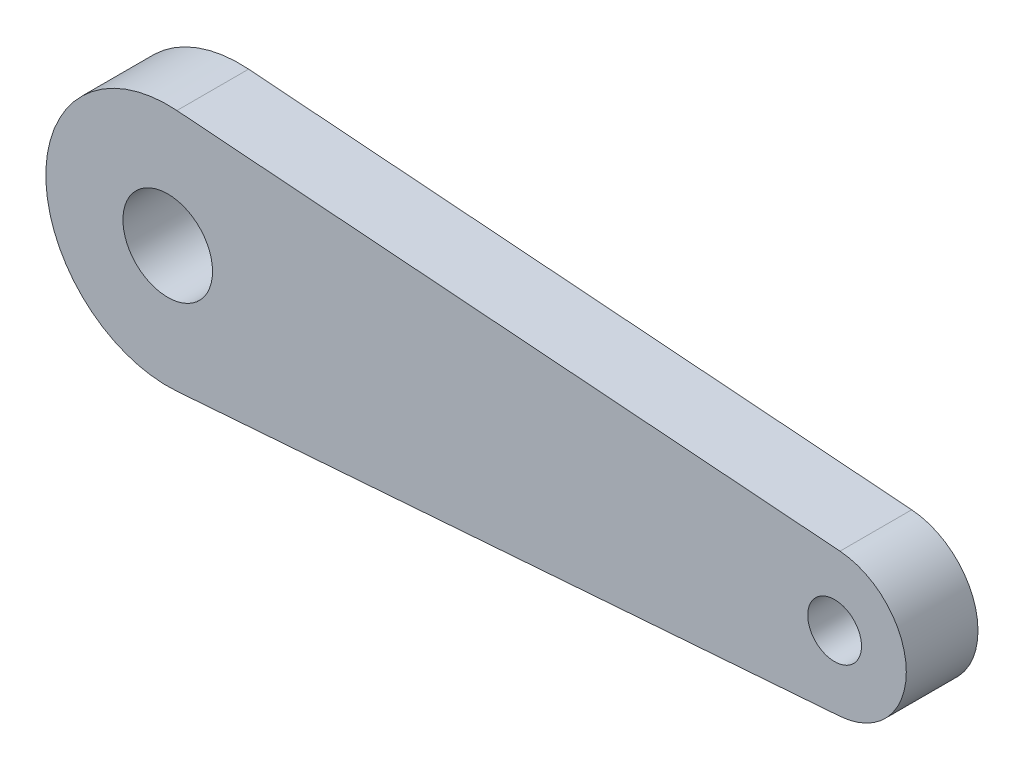
ISO-10303-21;
HEADER;
FILE_DESCRIPTION(('STEP AP214'),'2;1');
FILE_NAME('part.step','',(''),(''),'','','');
FILE_SCHEMA(('AUTOMOTIVE_DESIGN { 1 0 10303 214 1 1 1 1 }'));
ENDSEC;
DATA;
#1=APPLICATION_CONTEXT('core data for automotive mechanical design processes');
#2=APPLICATION_PROTOCOL_DEFINITION('international standard','automotive_design',2000,#1);
#3=PRODUCT_CONTEXT('',#1,'mechanical');
#4=PRODUCT('Part','Part','',(#3));
#5=PRODUCT_RELATED_PRODUCT_CATEGORY('part','',(#4));
#6=PRODUCT_DEFINITION_FORMATION('','',#4);
#7=PRODUCT_DEFINITION_CONTEXT('part definition',#1,'design');
#8=PRODUCT_DEFINITION('design','',#6,#7);
#9=PRODUCT_DEFINITION_SHAPE('','',#8);
#10=(LENGTH_UNIT() NAMED_UNIT(*) SI_UNIT(.MILLI.,.METRE.));
#11=(NAMED_UNIT(*) PLANE_ANGLE_UNIT() SI_UNIT($,.RADIAN.));
#12=(NAMED_UNIT(*) SI_UNIT($,.STERADIAN.) SOLID_ANGLE_UNIT());
#13=UNCERTAINTY_MEASURE_WITH_UNIT(LENGTH_MEASURE(1.E-05),#10,'distance_accuracy_value','');
#14=(GEOMETRIC_REPRESENTATION_CONTEXT(3) GLOBAL_UNCERTAINTY_ASSIGNED_CONTEXT((#13)) GLOBAL_UNIT_ASSIGNED_CONTEXT((#10,
#11,#12)) REPRESENTATION_CONTEXT('',''));
#15=CARTESIAN_POINT('',(0.,0.,0.));
#16=DIRECTION('',(0.,0.,1.));
#17=DIRECTION('',(1.,0.,0.));
#18=AXIS2_PLACEMENT_3D('',#15,#16,#17);
#19=CARTESIAN_POINT('',(0.,0.,2.));
#20=DIRECTION('',(0.,0.,-1.));
#21=DIRECTION('',(-1.,0.,0.));
#22=AXIS2_PLACEMENT_3D('',#19,#20,#21);
#23=PLANE('',#22);
#24=CARTESIAN_POINT('',(0.,0.,2.));
#25=DIRECTION('',(0.,0.,1.));
#26=DIRECTION('',(-1.,0.,0.));
#27=AXIS2_PLACEMENT_3D('',#24,#25,#26);
#28=CIRCLE('',#27,3.4);
#29=CARTESIAN_POINT('',(0.255913978494622,3.3903551488909,2.));
#30=VERTEX_POINT('',#29);
#31=CARTESIAN_POINT('',(0.255913978494624,-3.3903551488909,2.));
#32=VERTEX_POINT('',#31);
#33=EDGE_CURVE('E85',#30,#32,#28,.T.);
#34=ORIENTED_EDGE('',*,*,#33,.T.);
#35=DIRECTION('',(0.997163279085559,0.0752688172043011,0.));
#36=VECTOR('',#35,1.);
#37=CARTESIAN_POINT('',(0.255913978494624,-3.3903551488909,2.));
#38=LINE('',#37,#36);
#39=CARTESIAN_POINT('',(18.7505376344086,-1.99432655817112,2.));
#40=VERTEX_POINT('',#39);
#41=EDGE_CURVE('E80',#32,#40,#38,.T.);
#42=ORIENTED_EDGE('',*,*,#41,.T.);
#43=CARTESIAN_POINT('',(18.6,0.,2.));
#44=DIRECTION('',(0.,0.,1.));
#45=DIRECTION('',(-1.,0.,0.));
#46=AXIS2_PLACEMENT_3D('',#43,#44,#45);
#47=CIRCLE('',#46,2.);
#48=CARTESIAN_POINT('',(18.7505376344086,1.99432655817112,2.));
#49=VERTEX_POINT('',#48);
#50=EDGE_CURVE('E83',#40,#49,#47,.T.);
#51=ORIENTED_EDGE('',*,*,#50,.T.);
#52=DIRECTION('',(-0.99716327908556,0.0752688172043012,0.));
#53=VECTOR('',#52,1.);
#54=CARTESIAN_POINT('',(0.255913978494622,3.3903551488909,2.));
#55=LINE('',#54,#53);
#56=EDGE_CURVE('E50',#49,#30,#55,.T.);
#57=ORIENTED_EDGE('',*,*,#56,.T.);
#58=EDGE_LOOP('',(#34,#42,#51,#57));
#59=FACE_BOUND('',#58,.T.);
#60=CARTESIAN_POINT('',(18.6,0.,2.));
#61=DIRECTION('',(0.,0.,1.));
#62=DIRECTION('',(1.,0.,0.));
#63=AXIS2_PLACEMENT_3D('',#60,#61,#62);
#64=CIRCLE('',#63,0.750000000000002);
#65=CARTESIAN_POINT('',(19.35,0.,2.));
#66=VERTEX_POINT('',#65);
#67=EDGE_CURVE('E100',#66,#66,#64,.T.);
#68=ORIENTED_EDGE('',*,*,#67,.F.);
#69=EDGE_LOOP('',(#68));
#70=FACE_BOUND('',#69,.T.);
#71=CARTESIAN_POINT('',(0.,0.,2.));
#72=DIRECTION('',(0.,0.,1.));
#73=DIRECTION('',(1.,0.,0.));
#74=AXIS2_PLACEMENT_3D('',#71,#72,#73);
#75=CIRCLE('',#74,1.25);
#76=CARTESIAN_POINT('',(1.25,0.,2.));
#77=VERTEX_POINT('',#76);
#78=EDGE_CURVE('E115',#77,#77,#75,.T.);
#79=ORIENTED_EDGE('',*,*,#78,.F.);
#80=EDGE_LOOP('',(#79));
#81=FACE_BOUND('',#80,.T.);
#82=ADVANCED_FACE('F33',(#59,#70,#81),#23,.F.);
#83=CARTESIAN_POINT('',(0.,0.,0.));
#84=DIRECTION('',(0.,0.,-1.));
#85=DIRECTION('',(-1.,0.,0.));
#86=AXIS2_PLACEMENT_3D('',#83,#84,#85);
#87=PLANE('',#86);
#88=CARTESIAN_POINT('',(18.6,0.,0.));
#89=DIRECTION('',(0.,0.,1.));
#90=DIRECTION('',(1.,0.,0.));
#91=AXIS2_PLACEMENT_3D('',#88,#89,#90);
#92=CIRCLE('',#91,0.750000000000002);
#93=CARTESIAN_POINT('',(19.35,0.,0.));
#94=VERTEX_POINT('',#93);
#95=EDGE_CURVE('E112',#94,#94,#92,.T.);
#96=ORIENTED_EDGE('',*,*,#95,.T.);
#97=EDGE_LOOP('',(#96));
#98=FACE_BOUND('',#97,.T.);
#99=CARTESIAN_POINT('',(0.,0.,0.));
#100=DIRECTION('',(0.,0.,1.));
#101=DIRECTION('',(-1.,0.,0.));
#102=AXIS2_PLACEMENT_3D('',#99,#100,#101);
#103=CIRCLE('',#102,3.4);
#104=CARTESIAN_POINT('',(0.255913978494622,3.3903551488909,0.));
#105=VERTEX_POINT('',#104);
#106=CARTESIAN_POINT('',(0.255913978494624,-3.3903551488909,0.));
#107=VERTEX_POINT('',#106);
#108=EDGE_CURVE('E97',#105,#107,#103,.T.);
#109=ORIENTED_EDGE('',*,*,#108,.F.);
#110=DIRECTION('',(-0.99716327908556,0.0752688172043012,0.));
#111=VECTOR('',#110,1.);
#112=CARTESIAN_POINT('',(0.255913978494622,3.3903551488909,0.));
#113=LINE('',#112,#111);
#114=CARTESIAN_POINT('',(18.7505376344086,1.99432655817112,0.));
#115=VERTEX_POINT('',#114);
#116=EDGE_CURVE('E73',#115,#105,#113,.T.);
#117=ORIENTED_EDGE('',*,*,#116,.F.);
#118=CARTESIAN_POINT('',(18.6,0.,0.));
#119=DIRECTION('',(0.,0.,1.));
#120=DIRECTION('',(-1.,0.,0.));
#121=AXIS2_PLACEMENT_3D('',#118,#119,#120);
#122=CIRCLE('',#121,2.);
#123=CARTESIAN_POINT('',(18.7505376344086,-1.99432655817112,0.));
#124=VERTEX_POINT('',#123);
#125=EDGE_CURVE('E67',#124,#115,#122,.T.);
#126=ORIENTED_EDGE('',*,*,#125,.F.);
#127=DIRECTION('',(0.997163279085559,0.0752688172043011,0.));
#128=VECTOR('',#127,1.);
#129=CARTESIAN_POINT('',(0.255913978494624,-3.3903551488909,0.));
#130=LINE('',#129,#128);
#131=EDGE_CURVE('E89',#107,#124,#130,.T.);
#132=ORIENTED_EDGE('',*,*,#131,.F.);
#133=EDGE_LOOP('',(#109,#117,#126,#132));
#134=FACE_BOUND('',#133,.T.);
#135=CARTESIAN_POINT('',(0.,0.,0.));
#136=DIRECTION('',(0.,0.,1.));
#137=DIRECTION('',(1.,0.,0.));
#138=AXIS2_PLACEMENT_3D('',#135,#136,#137);
#139=CIRCLE('',#138,1.25);
#140=CARTESIAN_POINT('',(1.25,0.,0.));
#141=VERTEX_POINT('',#140);
#142=EDGE_CURVE('E118',#141,#141,#139,.T.);
#143=ORIENTED_EDGE('',*,*,#142,.T.);
#144=EDGE_LOOP('',(#143));
#145=FACE_BOUND('',#144,.T.);
#146=ADVANCED_FACE('F108',(#98,#134,#145),#87,.T.);
#147=CARTESIAN_POINT('',(0.,0.,2.));
#148=DIRECTION('',(0.,0.,-1.));
#149=DIRECTION('',(-1.,0.,0.));
#150=AXIS2_PLACEMENT_3D('',#147,#148,#149);
#151=CYLINDRICAL_SURFACE('',#150,3.4);
#152=ORIENTED_EDGE('',*,*,#108,.T.);
#153=DIRECTION('',(0.,0.,-1.));
#154=VECTOR('',#153,1.);
#155=CARTESIAN_POINT('',(0.255913978494624,-3.3903551488909,2.));
#156=LINE('',#155,#154);
#157=EDGE_CURVE('E11',#32,#107,#156,.T.);
#158=ORIENTED_EDGE('',*,*,#157,.F.);
#159=ORIENTED_EDGE('',*,*,#33,.F.);
#160=DIRECTION('',(0.,0.,-1.));
#161=VECTOR('',#160,1.);
#162=CARTESIAN_POINT('',(0.255913978494622,3.3903551488909,2.));
#163=LINE('',#162,#161);
#164=EDGE_CURVE('E93',#30,#105,#163,.T.);
#165=ORIENTED_EDGE('',*,*,#164,.T.);
#166=EDGE_LOOP('',(#152,#158,#159,#165));
#167=FACE_BOUND('',#166,.T.);
#168=ADVANCED_FACE('F35',(#167),#151,.T.);
#169=CARTESIAN_POINT('',(0.255913978494624,-3.3903551488909,2.));
#170=DIRECTION('',(-0.0752688172043011,0.99716327908556,0.));
#171=DIRECTION('',(-0.99716327908556,-0.0752688172043011,0.));
#172=AXIS2_PLACEMENT_3D('',#169,#170,#171);
#173=PLANE('',#172);
#174=ORIENTED_EDGE('',*,*,#131,.T.);
#175=DIRECTION('',(0.,0.,-1.));
#176=VECTOR('',#175,1.);
#177=CARTESIAN_POINT('',(18.7505376344086,-1.99432655817112,2.));
#178=LINE('',#177,#176);
#179=EDGE_CURVE('E42',#40,#124,#178,.T.);
#180=ORIENTED_EDGE('',*,*,#179,.F.);
#181=ORIENTED_EDGE('',*,*,#41,.F.);
#182=ORIENTED_EDGE('',*,*,#157,.T.);
#183=EDGE_LOOP('',(#174,#180,#181,#182));
#184=FACE_BOUND('',#183,.T.);
#185=ADVANCED_FACE('F88',(#184),#173,.F.);
#186=CARTESIAN_POINT('',(18.6,0.,2.));
#187=DIRECTION('',(0.,0.,-1.));
#188=DIRECTION('',(-1.,0.,0.));
#189=AXIS2_PLACEMENT_3D('',#186,#187,#188);
#190=CYLINDRICAL_SURFACE('',#189,2.);
#191=ORIENTED_EDGE('',*,*,#125,.T.);
#192=DIRECTION('',(0.,0.,-1.));
#193=VECTOR('',#192,1.);
#194=CARTESIAN_POINT('',(18.7505376344086,1.99432655817112,2.));
#195=LINE('',#194,#193);
#196=EDGE_CURVE('E90',#49,#115,#195,.T.);
#197=ORIENTED_EDGE('',*,*,#196,.F.);
#198=ORIENTED_EDGE('',*,*,#50,.F.);
#199=ORIENTED_EDGE('',*,*,#179,.T.);
#200=EDGE_LOOP('',(#191,#197,#198,#199));
#201=FACE_BOUND('',#200,.T.);
#202=ADVANCED_FACE('F91',(#201),#190,.T.);
#203=CARTESIAN_POINT('',(0.255913978494622,3.3903551488909,2.));
#204=DIRECTION('',(-0.0752688172043012,-0.99716327908556,0.));
#205=DIRECTION('',(0.997163279085559,-0.0752688172043012,0.));
#206=AXIS2_PLACEMENT_3D('',#203,#204,#205);
#207=PLANE('',#206);
#208=ORIENTED_EDGE('',*,*,#116,.T.);
#209=ORIENTED_EDGE('',*,*,#164,.F.);
#210=ORIENTED_EDGE('',*,*,#56,.F.);
#211=ORIENTED_EDGE('',*,*,#196,.T.);
#212=EDGE_LOOP('',(#208,#209,#210,#211));
#213=FACE_BOUND('',#212,.T.);
#214=ADVANCED_FACE('F105',(#213),#207,.F.);
#215=CARTESIAN_POINT('',(18.6,0.,2.));
#216=DIRECTION('',(0.,0.,-1.));
#217=DIRECTION('',(-1.,0.,0.));
#218=AXIS2_PLACEMENT_3D('',#215,#216,#217);
#219=CYLINDRICAL_SURFACE('',#218,0.750000000000002);
#220=ORIENTED_EDGE('',*,*,#67,.T.);
#221=EDGE_LOOP('',(#220));
#222=FACE_BOUND('',#221,.T.);
#223=ORIENTED_EDGE('',*,*,#95,.F.);
#224=EDGE_LOOP('',(#223));
#225=FACE_BOUND('',#224,.T.);
#226=ADVANCED_FACE('F135',(#222,#225),#219,.F.);
#227=CARTESIAN_POINT('',(0.,0.,2.));
#228=DIRECTION('',(0.,0.,-1.));
#229=DIRECTION('',(-1.,0.,0.));
#230=AXIS2_PLACEMENT_3D('',#227,#228,#229);
#231=CYLINDRICAL_SURFACE('',#230,1.25);
#232=ORIENTED_EDGE('',*,*,#78,.T.);
#233=EDGE_LOOP('',(#232));
#234=FACE_BOUND('',#233,.T.);
#235=ORIENTED_EDGE('',*,*,#142,.F.);
#236=EDGE_LOOP('',(#235));
#237=FACE_BOUND('',#236,.T.);
#238=ADVANCED_FACE('F124',(#234,#237),#231,.F.);
#239=CLOSED_SHELL('',(#82,#146,#168,#185,#202,#214,#226,#238));
#240=MANIFOLD_SOLID_BREP('B2',#239);
#241=ADVANCED_BREP_SHAPE_REPRESENTATION('',(#18,#240),#14);
#242=SHAPE_DEFINITION_REPRESENTATION(#9,#241);
ENDSEC;
END-ISO-10303-21;
